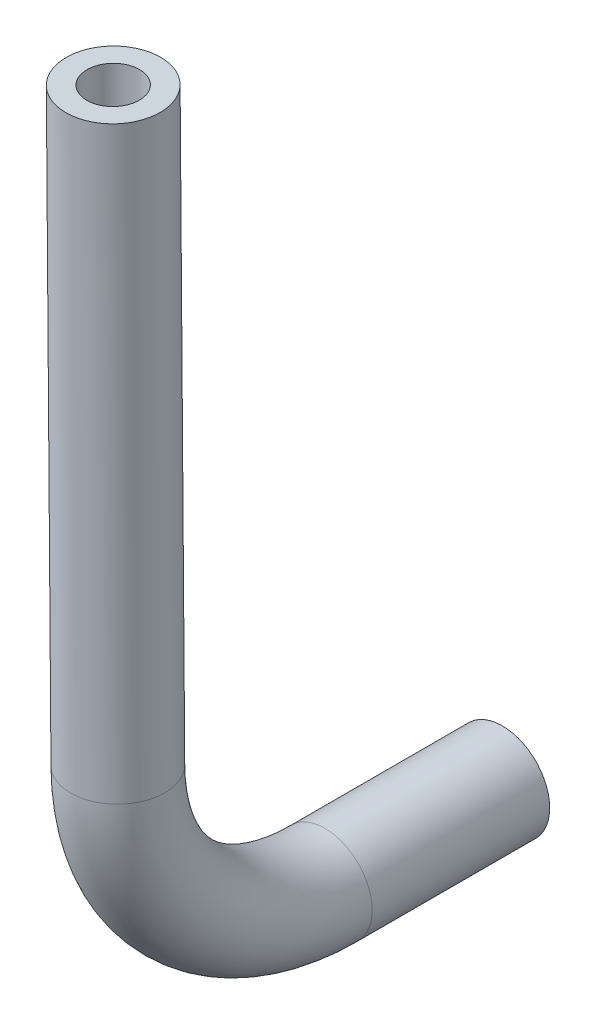
ISO-10303-21;
HEADER;
FILE_DESCRIPTION(('STEP AP214'),'2;1');
FILE_NAME('part.step','',(''),(''),'','','');
FILE_SCHEMA(('AUTOMOTIVE_DESIGN { 1 0 10303 214 1 1 1 1 }'));
ENDSEC;
DATA;
#1=APPLICATION_CONTEXT('core data for automotive mechanical design processes');
#2=APPLICATION_PROTOCOL_DEFINITION('international standard','automotive_design',2000,#1);
#3=PRODUCT_CONTEXT('',#1,'mechanical');
#4=PRODUCT('Part','Part','',(#3));
#5=PRODUCT_RELATED_PRODUCT_CATEGORY('part','',(#4));
#6=PRODUCT_DEFINITION_FORMATION('','',#4);
#7=PRODUCT_DEFINITION_CONTEXT('part definition',#1,'design');
#8=PRODUCT_DEFINITION('design','',#6,#7);
#9=PRODUCT_DEFINITION_SHAPE('','',#8);
#10=(LENGTH_UNIT() NAMED_UNIT(*) SI_UNIT(.MILLI.,.METRE.));
#11=(NAMED_UNIT(*) PLANE_ANGLE_UNIT() SI_UNIT($,.RADIAN.));
#12=(NAMED_UNIT(*) SI_UNIT($,.STERADIAN.) SOLID_ANGLE_UNIT());
#13=UNCERTAINTY_MEASURE_WITH_UNIT(LENGTH_MEASURE(1.E-05),#10,'distance_accuracy_value','');
#14=(GEOMETRIC_REPRESENTATION_CONTEXT(3) GLOBAL_UNCERTAINTY_ASSIGNED_CONTEXT((#13)) GLOBAL_UNIT_ASSIGNED_CONTEXT((#10,
#11,#12)) REPRESENTATION_CONTEXT('',''));
#15=CARTESIAN_POINT('',(0.,0.,0.));
#16=DIRECTION('',(0.,0.,1.));
#17=DIRECTION('',(1.,0.,0.));
#18=AXIS2_PLACEMENT_3D('',#15,#16,#17);
#19=CARTESIAN_POINT('',(0.,7.,0.));
#20=DIRECTION('',(-1.,0.,0.));
#21=DIRECTION('',(0.,0.,1.));
#22=AXIS2_PLACEMENT_3D('',#19,#20,#21);
#23=TOROIDAL_SURFACE('',#22,7.,1.6);
#24=CARTESIAN_POINT('',(0.,0.,0.));
#25=DIRECTION('',(0.,0.,1.));
#26=DIRECTION('',(1.,0.,0.));
#27=AXIS2_PLACEMENT_3D('',#24,#25,#26);
#28=CIRCLE('',#27,1.6);
#29=CARTESIAN_POINT('',(0.,-1.6,0.));
#30=VERTEX_POINT('',#29);
#31=EDGE_CURVE('E51',#30,#30,#28,.T.);
#32=CARTESIAN_POINT('',(0.,6.94488359834917,6.99978300965602));
#33=DIRECTION('',(0.,0.999969001379431,0.00787377166440469));
#34=DIRECTION('',(1.,0.,0.));
#35=AXIS2_PLACEMENT_3D('',#32,#33,#34);
#36=CIRCLE('',#35,1.6);
#37=CARTESIAN_POINT('',(0.,6.93228556368612,8.59973341186311));
#38=VERTEX_POINT('',#37);
#39=EDGE_CURVE('E40',#38,#38,#36,.T.);
#40=CARTESIAN_POINT('',(0.,7.,0.));
#41=DIRECTION('',(-1.,0.,0.));
#42=DIRECTION('',(0.,0.,1.));
#43=AXIS2_PLACEMENT_3D('',#40,#41,#42);
#44=CIRCLE('',#43,8.6);
#45=EDGE_CURVE('',#30,#38,#44,.T.);
#46=ORIENTED_EDGE('',*,*,#31,.T.);
#47=ORIENTED_EDGE('',*,*,#39,.F.);
#48=ORIENTED_EDGE('',*,*,#45,.T.);
#49=ORIENTED_EDGE('',*,*,#45,.F.);
#50=EDGE_LOOP('',(#46,#48,#47,#49));
#51=FACE_BOUND('',#50,.T.);
#52=ADVANCED_FACE('F37',(#51),#23,.T.);
#53=CARTESIAN_POINT('',(0.,7.,0.));
#54=DIRECTION('',(-1.,0.,0.));
#55=DIRECTION('',(0.,0.,1.));
#56=AXIS2_PLACEMENT_3D('',#53,#54,#55);
#57=TOROIDAL_SURFACE('',#56,7.,0.89);
#58=CARTESIAN_POINT('',(0.,0.,0.));
#59=DIRECTION('',(0.,0.,1.));
#60=DIRECTION('',(1.,0.,0.));
#61=AXIS2_PLACEMENT_3D('',#58,#59,#60);
#62=CIRCLE('',#61,0.89);
#63=CARTESIAN_POINT('',(0.,-0.890000000000001,0.));
#64=VERTEX_POINT('',#63);
#65=EDGE_CURVE('E59',#64,#64,#62,.T.);
#66=CARTESIAN_POINT('',(0.,6.94488359834917,6.99978300965602));
#67=DIRECTION('',(0.,0.999969001379431,0.00787377166440469));
#68=DIRECTION('',(1.,0.,0.));
#69=AXIS2_PLACEMENT_3D('',#66,#67,#68);
#70=CIRCLE('',#69,0.89);
#71=CARTESIAN_POINT('',(0.,6.93787594156785,7.88975542088371));
#72=VERTEX_POINT('',#71);
#73=EDGE_CURVE('E10',#72,#72,#70,.F.);
#74=CARTESIAN_POINT('',(0.,7.,0.));
#75=DIRECTION('',(-1.,0.,0.));
#76=DIRECTION('',(0.,0.,1.));
#77=AXIS2_PLACEMENT_3D('',#74,#75,#76);
#78=CIRCLE('',#77,7.89);
#79=EDGE_CURVE('',#64,#72,#78,.T.);
#80=ORIENTED_EDGE('',*,*,#65,.F.);
#81=ORIENTED_EDGE('',*,*,#73,.F.);
#82=ORIENTED_EDGE('',*,*,#79,.T.);
#83=ORIENTED_EDGE('',*,*,#79,.F.);
#84=EDGE_LOOP('',(#80,#82,#81,#83));
#85=FACE_BOUND('',#84,.T.);
#86=ADVANCED_FACE('F93',(#85),#57,.F.);
#87=CARTESIAN_POINT('',(0.,0.,-6.));
#88=DIRECTION('',(0.,0.,1.));
#89=DIRECTION('',(1.,0.,0.));
#90=AXIS2_PLACEMENT_3D('',#87,#88,#89);
#91=CYLINDRICAL_SURFACE('',#90,1.6);
#92=CARTESIAN_POINT('',(0.,0.,-6.));
#93=DIRECTION('',(0.,0.,1.));
#94=DIRECTION('',(1.,0.,0.));
#95=AXIS2_PLACEMENT_3D('',#92,#93,#94);
#96=CIRCLE('',#95,1.6);
#97=CARTESIAN_POINT('',(1.6,0.,-6.));
#98=VERTEX_POINT('',#97);
#99=EDGE_CURVE('E49',#98,#98,#96,.T.);
#100=ORIENTED_EDGE('',*,*,#99,.T.);
#101=EDGE_LOOP('',(#100));
#102=FACE_BOUND('',#101,.T.);
#103=ORIENTED_EDGE('',*,*,#31,.F.);
#104=EDGE_LOOP('',(#103));
#105=FACE_BOUND('',#104,.T.);
#106=ADVANCED_FACE('F95',(#102,#105),#91,.T.);
#107=CARTESIAN_POINT('',(0.,0.,-6.));
#108=DIRECTION('',(0.,0.,1.));
#109=DIRECTION('',(1.,0.,0.));
#110=AXIS2_PLACEMENT_3D('',#107,#108,#109);
#111=PLANE('',#110);
#112=CARTESIAN_POINT('',(0.,0.,-6.));
#113=DIRECTION('',(0.,0.,1.));
#114=DIRECTION('',(1.,0.,0.));
#115=AXIS2_PLACEMENT_3D('',#112,#113,#114);
#116=CIRCLE('',#115,0.89);
#117=CARTESIAN_POINT('',(0.89,0.,-6.));
#118=VERTEX_POINT('',#117);
#119=EDGE_CURVE('E55',#118,#118,#116,.T.);
#120=ORIENTED_EDGE('',*,*,#119,.T.);
#121=EDGE_LOOP('',(#120));
#122=FACE_BOUND('',#121,.T.);
#123=ORIENTED_EDGE('',*,*,#99,.F.);
#124=EDGE_LOOP('',(#123));
#125=FACE_BOUND('',#124,.T.);
#126=ADVANCED_FACE('F89',(#122,#125),#111,.F.);
#127=CARTESIAN_POINT('',(0.,0.,-6.));
#128=DIRECTION('',(0.,0.,1.));
#129=DIRECTION('',(1.,0.,0.));
#130=AXIS2_PLACEMENT_3D('',#127,#128,#129);
#131=CYLINDRICAL_SURFACE('',#130,0.89);
#132=ORIENTED_EDGE('',*,*,#119,.F.);
#133=EDGE_LOOP('',(#132));
#134=FACE_BOUND('',#133,.T.);
#135=ORIENTED_EDGE('',*,*,#65,.T.);
#136=EDGE_LOOP('',(#135));
#137=FACE_BOUND('',#136,.T.);
#138=ADVANCED_FACE('F80',(#134,#137),#131,.F.);
#139=CARTESIAN_POINT('',(0.,26.9442636259378,7.15725844294411));
#140=DIRECTION('',(0.,0.999969001379431,0.0078737716644047));
#141=DIRECTION('',(0.,-0.0078737716644047,0.999969001379431));
#142=AXIS2_PLACEMENT_3D('',#139,#140,#141);
#143=PLANE('',#142);
#144=CARTESIAN_POINT('',(0.,26.9442636259378,7.15725844294411));
#145=DIRECTION('',(0.,0.999969001379431,0.0078737716644047));
#146=DIRECTION('',(0.,-0.0078737716644047,0.999969001379431));
#147=AXIS2_PLACEMENT_3D('',#144,#145,#146);
#148=CIRCLE('',#147,1.6);
#149=CARTESIAN_POINT('',(0.,26.9316655912748,8.7572088451512));
#150=VERTEX_POINT('',#149);
#151=EDGE_CURVE('E63',#150,#150,#148,.T.);
#152=ORIENTED_EDGE('',*,*,#151,.T.);
#153=EDGE_LOOP('',(#152));
#154=FACE_BOUND('',#153,.T.);
#155=CARTESIAN_POINT('',(0.,26.9442636259378,7.15725844294411));
#156=DIRECTION('',(0.,0.999969001379431,0.0078737716644047));
#157=DIRECTION('',(0.,-0.0078737716644047,0.999969001379431));
#158=AXIS2_PLACEMENT_3D('',#155,#156,#157);
#159=CIRCLE('',#158,0.89);
#160=CARTESIAN_POINT('',(0.,26.9372559691565,8.04723085417181));
#161=VERTEX_POINT('',#160);
#162=EDGE_CURVE('E70',#161,#161,#159,.T.);
#163=ORIENTED_EDGE('',*,*,#162,.F.);
#164=EDGE_LOOP('',(#163));
#165=FACE_BOUND('',#164,.T.);
#166=ADVANCED_FACE('F77',(#154,#165),#143,.T.);
#167=CARTESIAN_POINT('',(0.,26.9442636259378,7.15725844294411));
#168=DIRECTION('',(0.,-0.999969001379431,-0.0078737716644047));
#169=DIRECTION('',(0.,0.0078737716644047,-0.999969001379431));
#170=AXIS2_PLACEMENT_3D('',#167,#168,#169);
#171=CYLINDRICAL_SURFACE('',#170,1.6);
#172=ORIENTED_EDGE('',*,*,#151,.F.);
#173=EDGE_LOOP('',(#172));
#174=FACE_BOUND('',#173,.T.);
#175=ORIENTED_EDGE('',*,*,#39,.T.);
#176=EDGE_LOOP('',(#175));
#177=FACE_BOUND('',#176,.T.);
#178=ADVANCED_FACE('F79',(#174,#177),#171,.T.);
#179=CARTESIAN_POINT('',(0.,26.9442636259378,7.15725844294411));
#180=DIRECTION('',(0.,-0.999969001379431,-0.0078737716644047));
#181=DIRECTION('',(0.,0.0078737716644047,-0.999969001379431));
#182=AXIS2_PLACEMENT_3D('',#179,#180,#181);
#183=CYLINDRICAL_SURFACE('',#182,0.89);
#184=ORIENTED_EDGE('',*,*,#162,.T.);
#185=EDGE_LOOP('',(#184));
#186=FACE_BOUND('',#185,.T.);
#187=ORIENTED_EDGE('',*,*,#73,.T.);
#188=EDGE_LOOP('',(#187));
#189=FACE_BOUND('',#188,.T.);
#190=ADVANCED_FACE('F75',(#186,#189),#183,.F.);
#191=CLOSED_SHELL('',(#52,#86,#106,#126,#138,#166,#178,#190));
#192=MANIFOLD_SOLID_BREP('B2',#191);
#193=ADVANCED_BREP_SHAPE_REPRESENTATION('',(#18,#192),#14);
#194=SHAPE_DEFINITION_REPRESENTATION(#9,#193);
ENDSEC;
END-ISO-10303-21;
